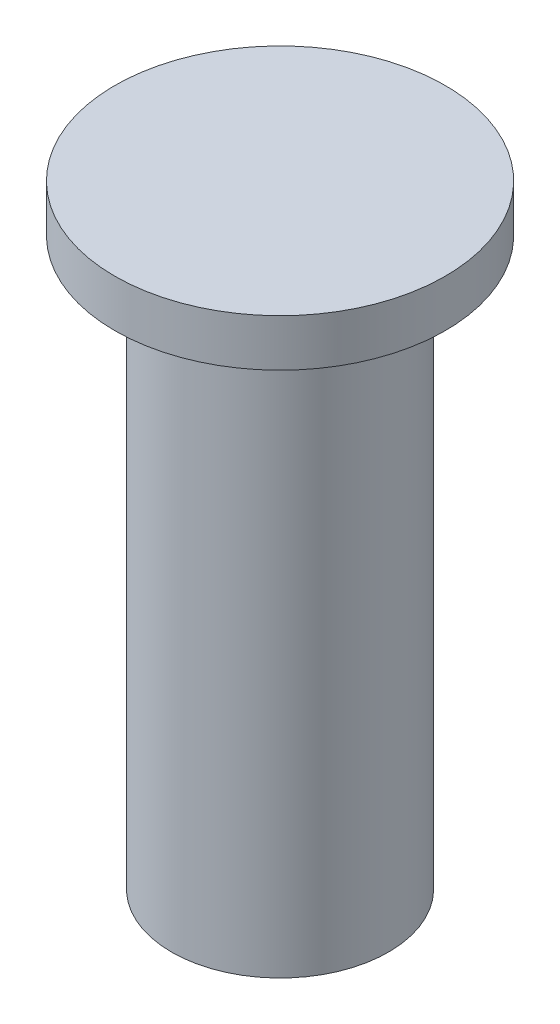
ISO-10303-21;
HEADER;
FILE_DESCRIPTION(('STEP AP214'),'2;1');
FILE_NAME('part.step','',(''),(''),'','','');
FILE_SCHEMA(('AUTOMOTIVE_DESIGN { 1 0 10303 214 1 1 1 1 }'));
ENDSEC;
DATA;
#1=APPLICATION_CONTEXT('core data for automotive mechanical design processes');
#2=APPLICATION_PROTOCOL_DEFINITION('international standard','automotive_design',2000,#1);
#3=PRODUCT_CONTEXT('',#1,'mechanical');
#4=PRODUCT('Part','Part','',(#3));
#5=PRODUCT_RELATED_PRODUCT_CATEGORY('part','',(#4));
#6=PRODUCT_DEFINITION_FORMATION('','',#4);
#7=PRODUCT_DEFINITION_CONTEXT('part definition',#1,'design');
#8=PRODUCT_DEFINITION('design','',#6,#7);
#9=PRODUCT_DEFINITION_SHAPE('','',#8);
#10=(LENGTH_UNIT() NAMED_UNIT(*) SI_UNIT(.MILLI.,.METRE.));
#11=(NAMED_UNIT(*) PLANE_ANGLE_UNIT() SI_UNIT($,.RADIAN.));
#12=(NAMED_UNIT(*) SI_UNIT($,.STERADIAN.) SOLID_ANGLE_UNIT());
#13=UNCERTAINTY_MEASURE_WITH_UNIT(LENGTH_MEASURE(1.E-05),#10,'distance_accuracy_value','');
#14=(GEOMETRIC_REPRESENTATION_CONTEXT(3) GLOBAL_UNCERTAINTY_ASSIGNED_CONTEXT((#13)) GLOBAL_UNIT_ASSIGNED_CONTEXT((#10,
#11,#12)) REPRESENTATION_CONTEXT('',''));
#15=CARTESIAN_POINT('',(0.,0.,0.));
#16=DIRECTION('',(0.,0.,1.));
#17=DIRECTION('',(1.,0.,0.));
#18=AXIS2_PLACEMENT_3D('',#15,#16,#17);
#19=CARTESIAN_POINT('',(0.,12.,0.));
#20=DIRECTION('',(0.,-1.,0.));
#21=DIRECTION('',(0.,0.,-1.));
#22=AXIS2_PLACEMENT_3D('',#19,#20,#21);
#23=CYLINDRICAL_SURFACE('',#22,2.3);
#24=CARTESIAN_POINT('',(0.,12.,0.));
#25=DIRECTION('',(0.,1.,0.));
#26=DIRECTION('',(0.,0.,1.));
#27=AXIS2_PLACEMENT_3D('',#24,#25,#26);
#28=CIRCLE('',#27,2.3);
#29=CARTESIAN_POINT('',(0.,12.,2.3));
#30=VERTEX_POINT('',#29);
#31=EDGE_CURVE('E10',#30,#30,#28,.T.);
#32=ORIENTED_EDGE('',*,*,#31,.F.);
#33=EDGE_LOOP('',(#32));
#34=FACE_BOUND('',#33,.T.);
#35=CARTESIAN_POINT('',(0.,0.,0.));
#36=DIRECTION('',(0.,1.,0.));
#37=DIRECTION('',(0.,0.,1.));
#38=AXIS2_PLACEMENT_3D('',#35,#36,#37);
#39=CIRCLE('',#38,2.3);
#40=CARTESIAN_POINT('',(0.,0.,2.3));
#41=VERTEX_POINT('',#40);
#42=EDGE_CURVE('E44',#41,#41,#39,.T.);
#43=ORIENTED_EDGE('',*,*,#42,.T.);
#44=EDGE_LOOP('',(#43));
#45=FACE_BOUND('',#44,.T.);
#46=ADVANCED_FACE('F41',(#34,#45),#23,.T.);
#47=CARTESIAN_POINT('',(0.,0.,0.));
#48=DIRECTION('',(0.,1.,0.));
#49=DIRECTION('',(0.,0.,1.));
#50=AXIS2_PLACEMENT_3D('',#47,#48,#49);
#51=PLANE('',#50);
#52=ORIENTED_EDGE('',*,*,#42,.F.);
#53=EDGE_LOOP('',(#52));
#54=FACE_BOUND('',#53,.T.);
#55=ADVANCED_FACE('F68',(#54),#51,.F.);
#56=CARTESIAN_POINT('',(0.,13.,0.));
#57=DIRECTION('',(0.,-1.,0.));
#58=DIRECTION('',(0.,0.,-1.));
#59=AXIS2_PLACEMENT_3D('',#56,#57,#58);
#60=CYLINDRICAL_SURFACE('',#59,3.5);
#61=CARTESIAN_POINT('',(0.,13.,0.));
#62=DIRECTION('',(0.,1.,0.));
#63=DIRECTION('',(0.,0.,1.));
#64=AXIS2_PLACEMENT_3D('',#61,#62,#63);
#65=CIRCLE('',#64,3.5);
#66=CARTESIAN_POINT('',(0.,13.,3.5));
#67=VERTEX_POINT('',#66);
#68=EDGE_CURVE('E53',#67,#67,#65,.T.);
#69=ORIENTED_EDGE('',*,*,#68,.F.);
#70=EDGE_LOOP('',(#69));
#71=FACE_BOUND('',#70,.T.);
#72=CARTESIAN_POINT('',(0.,12.,0.));
#73=DIRECTION('',(0.,1.,0.));
#74=DIRECTION('',(0.,0.,1.));
#75=AXIS2_PLACEMENT_3D('',#72,#73,#74);
#76=CIRCLE('',#75,3.5);
#77=CARTESIAN_POINT('',(0.,12.,3.5));
#78=VERTEX_POINT('',#77);
#79=EDGE_CURVE('E55',#78,#78,#76,.T.);
#80=ORIENTED_EDGE('',*,*,#79,.T.);
#81=EDGE_LOOP('',(#80));
#82=FACE_BOUND('',#81,.T.);
#83=ADVANCED_FACE('F65',(#71,#82),#60,.T.);
#84=CARTESIAN_POINT('',(0.,13.,0.));
#85=DIRECTION('',(0.,1.,0.));
#86=DIRECTION('',(0.,0.,1.));
#87=AXIS2_PLACEMENT_3D('',#84,#85,#86);
#88=PLANE('',#87);
#89=ORIENTED_EDGE('',*,*,#68,.T.);
#90=EDGE_LOOP('',(#89));
#91=FACE_BOUND('',#90,.T.);
#92=ADVANCED_FACE('F63',(#91),#88,.T.);
#93=CARTESIAN_POINT('',(0.,12.,0.));
#94=DIRECTION('',(0.,1.,0.));
#95=DIRECTION('',(0.,0.,1.));
#96=AXIS2_PLACEMENT_3D('',#93,#94,#95);
#97=PLANE('',#96);
#98=ORIENTED_EDGE('',*,*,#31,.T.);
#99=EDGE_LOOP('',(#98));
#100=FACE_BOUND('',#99,.T.);
#101=ORIENTED_EDGE('',*,*,#79,.F.);
#102=EDGE_LOOP('',(#101));
#103=FACE_BOUND('',#102,.T.);
#104=ADVANCED_FACE('F72',(#100,#103),#97,.F.);
#105=CLOSED_SHELL('',(#46,#55,#83,#92,#104));
#106=MANIFOLD_SOLID_BREP('B2',#105);
#107=ADVANCED_BREP_SHAPE_REPRESENTATION('',(#18,#106),#14);
#108=SHAPE_DEFINITION_REPRESENTATION(#9,#107);
ENDSEC;
END-ISO-10303-21;
